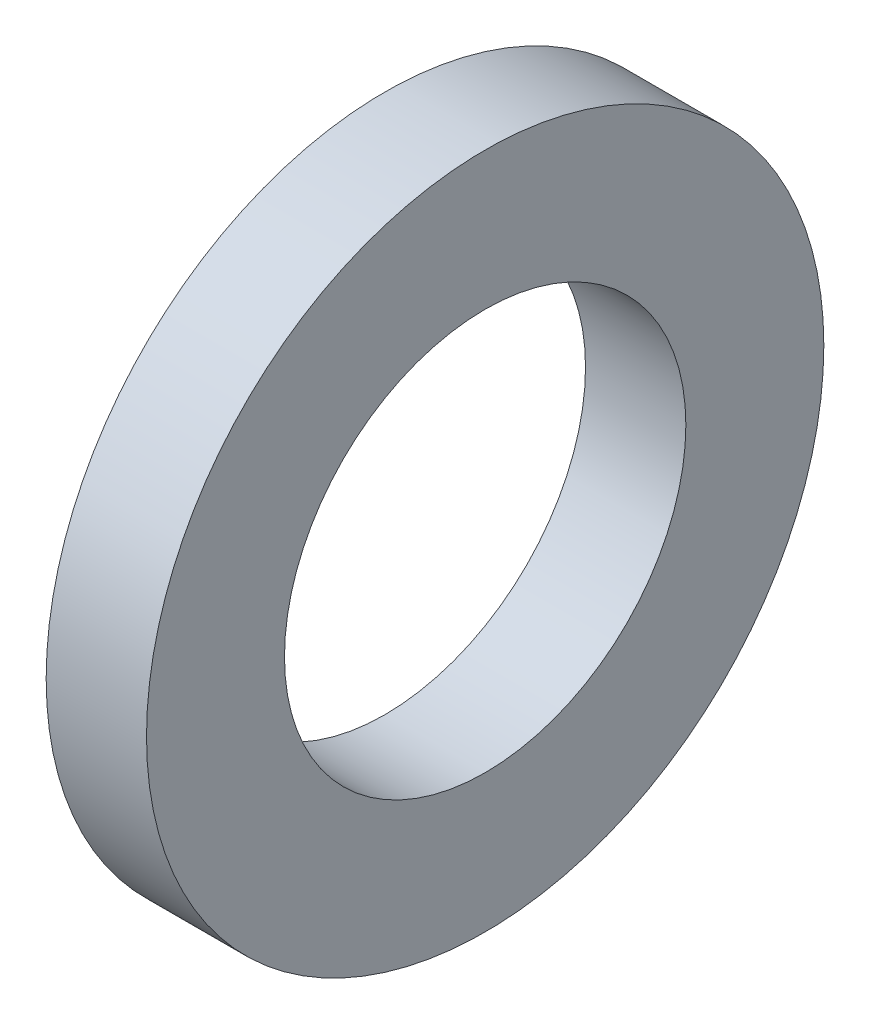
ISO-10303-21;
HEADER;
FILE_DESCRIPTION(('STEP AP214'),'2;1');
FILE_NAME('part.step','',(''),(''),'','','');
FILE_SCHEMA(('AUTOMOTIVE_DESIGN { 1 0 10303 214 1 1 1 1 }'));
ENDSEC;
DATA;
#1=APPLICATION_CONTEXT('core data for automotive mechanical design processes');
#2=APPLICATION_PROTOCOL_DEFINITION('international standard','automotive_design',2000,#1);
#3=PRODUCT_CONTEXT('',#1,'mechanical');
#4=PRODUCT('Part','Part','',(#3));
#5=PRODUCT_RELATED_PRODUCT_CATEGORY('part','',(#4));
#6=PRODUCT_DEFINITION_FORMATION('','',#4);
#7=PRODUCT_DEFINITION_CONTEXT('part definition',#1,'design');
#8=PRODUCT_DEFINITION('design','',#6,#7);
#9=PRODUCT_DEFINITION_SHAPE('','',#8);
#10=(LENGTH_UNIT() NAMED_UNIT(*) SI_UNIT(.MILLI.,.METRE.));
#11=(NAMED_UNIT(*) PLANE_ANGLE_UNIT() SI_UNIT($,.RADIAN.));
#12=(NAMED_UNIT(*) SI_UNIT($,.STERADIAN.) SOLID_ANGLE_UNIT());
#13=UNCERTAINTY_MEASURE_WITH_UNIT(LENGTH_MEASURE(1.E-05),#10,'distance_accuracy_value','');
#14=(GEOMETRIC_REPRESENTATION_CONTEXT(3) GLOBAL_UNCERTAINTY_ASSIGNED_CONTEXT((#13)) GLOBAL_UNIT_ASSIGNED_CONTEXT((#10,
#11,#12)) REPRESENTATION_CONTEXT('',''));
#15=CARTESIAN_POINT('',(0.,0.,0.));
#16=DIRECTION('',(0.,0.,1.));
#17=DIRECTION('',(1.,0.,0.));
#18=AXIS2_PLACEMENT_3D('',#15,#16,#17);
#19=CARTESIAN_POINT('',(2.,0.,0.));
#20=DIRECTION('',(-1.,0.,0.));
#21=DIRECTION('',(0.,0.,1.));
#22=AXIS2_PLACEMENT_3D('',#19,#20,#21);
#23=CYLINDRICAL_SURFACE('',#22,6.75);
#24=CARTESIAN_POINT('',(2.,0.,0.));
#25=DIRECTION('',(1.,0.,0.));
#26=DIRECTION('',(0.,0.,-1.));
#27=AXIS2_PLACEMENT_3D('',#24,#25,#26);
#28=CIRCLE('',#27,6.75);
#29=CARTESIAN_POINT('',(2.,0.,-6.75));
#30=VERTEX_POINT('',#29);
#31=EDGE_CURVE('E10',#30,#30,#28,.T.);
#32=ORIENTED_EDGE('',*,*,#31,.F.);
#33=EDGE_LOOP('',(#32));
#34=FACE_BOUND('',#33,.T.);
#35=CARTESIAN_POINT('',(0.,0.,0.));
#36=DIRECTION('',(1.,0.,0.));
#37=DIRECTION('',(0.,0.,-1.));
#38=AXIS2_PLACEMENT_3D('',#35,#36,#37);
#39=CIRCLE('',#38,6.75);
#40=CARTESIAN_POINT('',(0.,0.,-6.75));
#41=VERTEX_POINT('',#40);
#42=EDGE_CURVE('E34',#41,#41,#39,.T.);
#43=ORIENTED_EDGE('',*,*,#42,.T.);
#44=EDGE_LOOP('',(#43));
#45=FACE_BOUND('',#44,.T.);
#46=ADVANCED_FACE('F31',(#34,#45),#23,.T.);
#47=CARTESIAN_POINT('',(2.,0.,0.));
#48=DIRECTION('',(1.,0.,0.));
#49=DIRECTION('',(0.,0.,-1.));
#50=AXIS2_PLACEMENT_3D('',#47,#48,#49);
#51=PLANE('',#50);
#52=CARTESIAN_POINT('',(2.,0.,0.));
#53=DIRECTION('',(1.,0.,0.));
#54=DIRECTION('',(0.,0.,-1.));
#55=AXIS2_PLACEMENT_3D('',#52,#53,#54);
#56=CIRCLE('',#55,4.);
#57=CARTESIAN_POINT('',(2.,0.,-4.));
#58=VERTEX_POINT('',#57);
#59=EDGE_CURVE('E43',#58,#58,#56,.T.);
#60=ORIENTED_EDGE('',*,*,#59,.F.);
#61=EDGE_LOOP('',(#60));
#62=FACE_BOUND('',#61,.T.);
#63=ORIENTED_EDGE('',*,*,#31,.T.);
#64=EDGE_LOOP('',(#63));
#65=FACE_BOUND('',#64,.T.);
#66=ADVANCED_FACE('F58',(#62,#65),#51,.T.);
#67=CARTESIAN_POINT('',(0.,0.,0.));
#68=DIRECTION('',(1.,0.,0.));
#69=DIRECTION('',(0.,0.,-1.));
#70=AXIS2_PLACEMENT_3D('',#67,#68,#69);
#71=PLANE('',#70);
#72=CARTESIAN_POINT('',(0.,0.,0.));
#73=DIRECTION('',(1.,0.,0.));
#74=DIRECTION('',(0.,0.,-1.));
#75=AXIS2_PLACEMENT_3D('',#72,#73,#74);
#76=CIRCLE('',#75,4.);
#77=CARTESIAN_POINT('',(0.,0.,-4.));
#78=VERTEX_POINT('',#77);
#79=EDGE_CURVE('E41',#78,#78,#76,.T.);
#80=ORIENTED_EDGE('',*,*,#79,.T.);
#81=EDGE_LOOP('',(#80));
#82=FACE_BOUND('',#81,.T.);
#83=ORIENTED_EDGE('',*,*,#42,.F.);
#84=EDGE_LOOP('',(#83));
#85=FACE_BOUND('',#84,.T.);
#86=ADVANCED_FACE('F49',(#82,#85),#71,.F.);
#87=CARTESIAN_POINT('',(0.,0.,0.));
#88=DIRECTION('',(1.,0.,0.));
#89=DIRECTION('',(0.,0.,-1.));
#90=AXIS2_PLACEMENT_3D('',#87,#88,#89);
#91=CYLINDRICAL_SURFACE('',#90,4.);
#92=ORIENTED_EDGE('',*,*,#79,.F.);
#93=EDGE_LOOP('',(#92));
#94=FACE_BOUND('',#93,.T.);
#95=ORIENTED_EDGE('',*,*,#59,.T.);
#96=EDGE_LOOP('',(#95));
#97=FACE_BOUND('',#96,.T.);
#98=ADVANCED_FACE('F52',(#94,#97),#91,.F.);
#99=CLOSED_SHELL('',(#46,#66,#86,#98));
#100=MANIFOLD_SOLID_BREP('B2',#99);
#101=ADVANCED_BREP_SHAPE_REPRESENTATION('',(#18,#100),#14);
#102=SHAPE_DEFINITION_REPRESENTATION(#9,#101);
ENDSEC;
END-ISO-10303-21;
